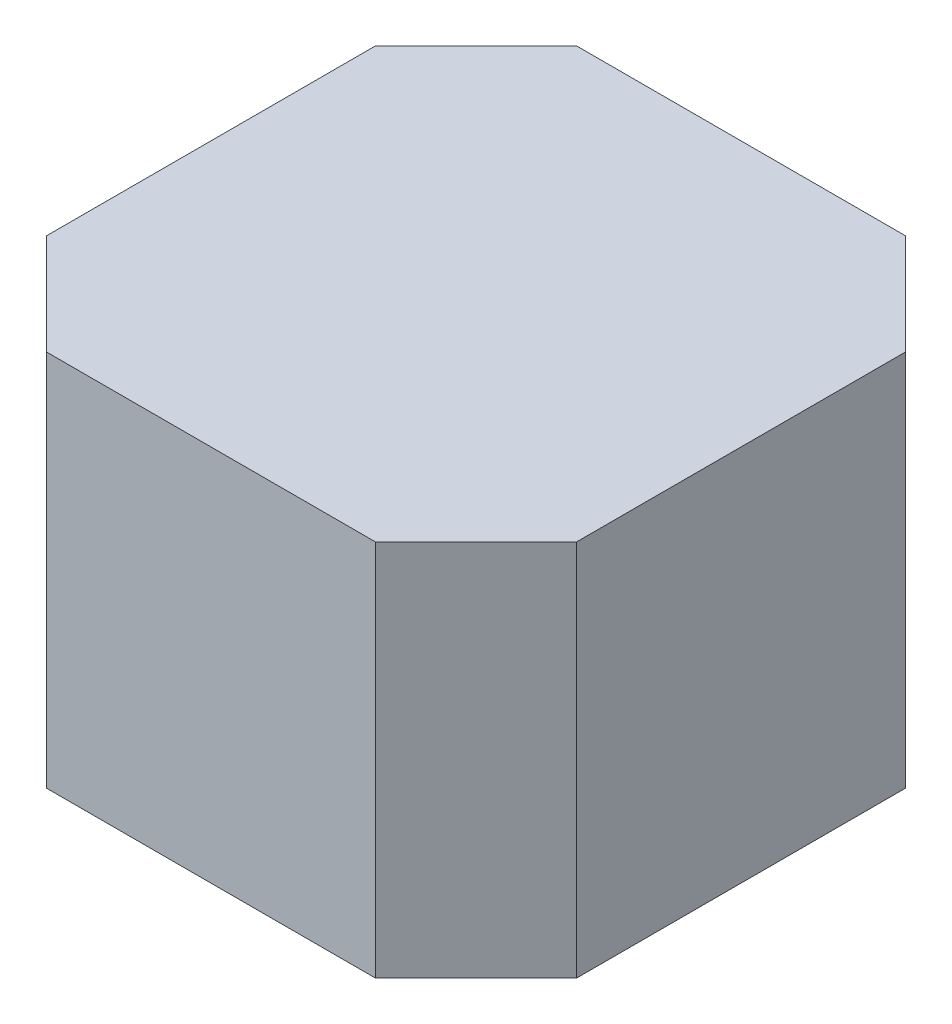
ISO-10303-21;
HEADER;
FILE_DESCRIPTION(('STEP AP214'),'2;1');
FILE_NAME('part.step','',(''),(''),'','','');
FILE_SCHEMA(('AUTOMOTIVE_DESIGN { 1 0 10303 214 1 1 1 1 }'));
ENDSEC;
DATA;
#1=APPLICATION_CONTEXT('core data for automotive mechanical design processes');
#2=APPLICATION_PROTOCOL_DEFINITION('international standard','automotive_design',2000,#1);
#3=PRODUCT_CONTEXT('',#1,'mechanical');
#4=PRODUCT('Part','Part','',(#3));
#5=PRODUCT_RELATED_PRODUCT_CATEGORY('part','',(#4));
#6=PRODUCT_DEFINITION_FORMATION('','',#4);
#7=PRODUCT_DEFINITION_CONTEXT('part definition',#1,'design');
#8=PRODUCT_DEFINITION('design','',#6,#7);
#9=PRODUCT_DEFINITION_SHAPE('','',#8);
#10=(LENGTH_UNIT() NAMED_UNIT(*) SI_UNIT(.MILLI.,.METRE.));
#11=(NAMED_UNIT(*) PLANE_ANGLE_UNIT() SI_UNIT($,.RADIAN.));
#12=(NAMED_UNIT(*) SI_UNIT($,.STERADIAN.) SOLID_ANGLE_UNIT());
#13=UNCERTAINTY_MEASURE_WITH_UNIT(LENGTH_MEASURE(1.E-05),#10,'distance_accuracy_value','');
#14=(GEOMETRIC_REPRESENTATION_CONTEXT(3) GLOBAL_UNCERTAINTY_ASSIGNED_CONTEXT((#13)) GLOBAL_UNIT_ASSIGNED_CONTEXT((#10,
#11,#12)) REPRESENTATION_CONTEXT('',''));
#15=CARTESIAN_POINT('',(0.,0.,0.));
#16=DIRECTION('',(0.,0.,1.));
#17=DIRECTION('',(1.,0.,0.));
#18=AXIS2_PLACEMENT_3D('',#15,#16,#17);
#19=CARTESIAN_POINT('',(21.05,30.,21.05));
#20=DIRECTION('',(-1.,0.,0.));
#21=DIRECTION('',(0.,0.,1.));
#22=AXIS2_PLACEMENT_3D('',#19,#20,#21);
#23=PLANE('',#22);
#24=DIRECTION('',(0.,0.,-1.));
#25=VECTOR('',#24,1.);
#26=CARTESIAN_POINT('',(21.05,0.,21.05));
#27=LINE('',#26,#25);
#28=CARTESIAN_POINT('',(21.05,0.,13.05));
#29=VERTEX_POINT('',#28);
#30=CARTESIAN_POINT('',(21.05,0.,-13.05));
#31=VERTEX_POINT('',#30);
#32=EDGE_CURVE('E128',#29,#31,#27,.T.);
#33=ORIENTED_EDGE('',*,*,#32,.T.);
#34=DIRECTION('',(0.,1.,0.));
#35=VECTOR('',#34,1.);
#36=CARTESIAN_POINT('',(21.05,30.,-13.05));
#37=LINE('',#36,#35);
#38=CARTESIAN_POINT('',(21.05,30.,-13.05));
#39=VERTEX_POINT('',#38);
#40=EDGE_CURVE('E151',#31,#39,#37,.T.);
#41=ORIENTED_EDGE('',*,*,#40,.T.);
#42=DIRECTION('',(0.,0.,-1.));
#43=VECTOR('',#42,1.);
#44=CARTESIAN_POINT('',(21.05,30.,21.05));
#45=LINE('',#44,#43);
#46=CARTESIAN_POINT('',(21.05,30.,13.05));
#47=VERTEX_POINT('',#46);
#48=EDGE_CURVE('E126',#47,#39,#45,.T.);
#49=ORIENTED_EDGE('',*,*,#48,.F.);
#50=DIRECTION('',(0.,-1.,0.));
#51=VECTOR('',#50,1.);
#52=CARTESIAN_POINT('',(21.05,30.,13.05));
#53=LINE('',#52,#51);
#54=EDGE_CURVE('E148',#47,#29,#53,.T.);
#55=ORIENTED_EDGE('',*,*,#54,.T.);
#56=EDGE_LOOP('',(#33,#41,#49,#55));
#57=FACE_BOUND('',#56,.T.);
#58=ADVANCED_FACE('F33',(#57),#23,.F.);
#59=CARTESIAN_POINT('',(-21.05,30.,-21.05));
#60=DIRECTION('',(0.,0.,1.));
#61=DIRECTION('',(1.,0.,0.));
#62=AXIS2_PLACEMENT_3D('',#59,#60,#61);
#63=PLANE('',#62);
#64=DIRECTION('',(-1.,0.,0.));
#65=VECTOR('',#64,1.);
#66=CARTESIAN_POINT('',(-21.05,0.,-21.05));
#67=LINE('',#66,#65);
#68=CARTESIAN_POINT('',(13.05,0.,-21.05));
#69=VERTEX_POINT('',#68);
#70=CARTESIAN_POINT('',(-13.05,0.,-21.05));
#71=VERTEX_POINT('',#70);
#72=EDGE_CURVE('E124',#69,#71,#67,.T.);
#73=ORIENTED_EDGE('',*,*,#72,.T.);
#74=DIRECTION('',(0.,1.,0.));
#75=VECTOR('',#74,1.);
#76=CARTESIAN_POINT('',(-13.05,30.,-21.05));
#77=LINE('',#76,#75);
#78=CARTESIAN_POINT('',(-13.05,30.,-21.05));
#79=VERTEX_POINT('',#78);
#80=EDGE_CURVE('E103',#71,#79,#77,.T.);
#81=ORIENTED_EDGE('',*,*,#80,.T.);
#82=DIRECTION('',(-1.,0.,0.));
#83=VECTOR('',#82,1.);
#84=CARTESIAN_POINT('',(-21.05,30.,-21.05));
#85=LINE('',#84,#83);
#86=CARTESIAN_POINT('',(13.05,30.,-21.05));
#87=VERTEX_POINT('',#86);
#88=EDGE_CURVE('E167',#87,#79,#85,.T.);
#89=ORIENTED_EDGE('',*,*,#88,.F.);
#90=DIRECTION('',(0.,-1.,0.));
#91=VECTOR('',#90,1.);
#92=CARTESIAN_POINT('',(13.05,30.,-21.05));
#93=LINE('',#92,#91);
#94=EDGE_CURVE('E108',#87,#69,#93,.T.);
#95=ORIENTED_EDGE('',*,*,#94,.T.);
#96=EDGE_LOOP('',(#73,#81,#89,#95));
#97=FACE_BOUND('',#96,.T.);
#98=ADVANCED_FACE('F184',(#97),#63,.F.);
#99=CARTESIAN_POINT('',(-21.05,30.,21.05));
#100=DIRECTION('',(1.,0.,0.));
#101=DIRECTION('',(0.,0.,-1.));
#102=AXIS2_PLACEMENT_3D('',#99,#100,#101);
#103=PLANE('',#102);
#104=DIRECTION('',(0.,0.,1.));
#105=VECTOR('',#104,1.);
#106=CARTESIAN_POINT('',(-21.05,30.,21.05));
#107=LINE('',#106,#105);
#108=CARTESIAN_POINT('',(-21.05,30.,-13.05));
#109=VERTEX_POINT('',#108);
#110=CARTESIAN_POINT('',(-21.05,30.,13.05));
#111=VERTEX_POINT('',#110);
#112=EDGE_CURVE('E117',#109,#111,#107,.T.);
#113=ORIENTED_EDGE('',*,*,#112,.F.);
#114=DIRECTION('',(0.,-1.,0.));
#115=VECTOR('',#114,1.);
#116=CARTESIAN_POINT('',(-21.05,30.,-13.05));
#117=LINE('',#116,#115);
#118=CARTESIAN_POINT('',(-21.05,0.,-13.05));
#119=VERTEX_POINT('',#118);
#120=EDGE_CURVE('E102',#109,#119,#117,.T.);
#121=ORIENTED_EDGE('',*,*,#120,.T.);
#122=DIRECTION('',(0.,0.,1.));
#123=VECTOR('',#122,1.);
#124=CARTESIAN_POINT('',(-21.05,0.,21.05));
#125=LINE('',#124,#123);
#126=CARTESIAN_POINT('',(-21.05,0.,13.05));
#127=VERTEX_POINT('',#126);
#128=EDGE_CURVE('E115',#119,#127,#125,.T.);
#129=ORIENTED_EDGE('',*,*,#128,.T.);
#130=DIRECTION('',(0.,1.,0.));
#131=VECTOR('',#130,1.);
#132=CARTESIAN_POINT('',(-21.05,30.,13.05));
#133=LINE('',#132,#131);
#134=EDGE_CURVE('E119',#127,#111,#133,.T.);
#135=ORIENTED_EDGE('',*,*,#134,.T.);
#136=EDGE_LOOP('',(#113,#121,#129,#135));
#137=FACE_BOUND('',#136,.T.);
#138=ADVANCED_FACE('F114',(#137),#103,.F.);
#139=CARTESIAN_POINT('',(-21.05,30.,21.05));
#140=DIRECTION('',(0.,0.,-1.));
#141=DIRECTION('',(-1.,0.,0.));
#142=AXIS2_PLACEMENT_3D('',#139,#140,#141);
#143=PLANE('',#142);
#144=DIRECTION('',(1.,0.,0.));
#145=VECTOR('',#144,1.);
#146=CARTESIAN_POINT('',(-21.05,0.,21.05));
#147=LINE('',#146,#145);
#148=CARTESIAN_POINT('',(-13.05,0.,21.05));
#149=VERTEX_POINT('',#148);
#150=CARTESIAN_POINT('',(13.05,0.,21.05));
#151=VERTEX_POINT('',#150);
#152=EDGE_CURVE('E123',#149,#151,#147,.T.);
#153=ORIENTED_EDGE('',*,*,#152,.T.);
#154=DIRECTION('',(0.,1.,0.));
#155=VECTOR('',#154,1.);
#156=CARTESIAN_POINT('',(13.05,30.,21.05));
#157=LINE('',#156,#155);
#158=CARTESIAN_POINT('',(13.05,30.,21.05));
#159=VERTEX_POINT('',#158);
#160=EDGE_CURVE('E11',#151,#159,#157,.T.);
#161=ORIENTED_EDGE('',*,*,#160,.T.);
#162=DIRECTION('',(1.,0.,0.));
#163=VECTOR('',#162,1.);
#164=CARTESIAN_POINT('',(-21.05,30.,21.05));
#165=LINE('',#164,#163);
#166=CARTESIAN_POINT('',(-13.05,30.,21.05));
#167=VERTEX_POINT('',#166);
#168=EDGE_CURVE('E132',#167,#159,#165,.T.);
#169=ORIENTED_EDGE('',*,*,#168,.F.);
#170=DIRECTION('',(0.,-1.,0.));
#171=VECTOR('',#170,1.);
#172=CARTESIAN_POINT('',(-13.05,30.,21.05));
#173=LINE('',#172,#171);
#174=EDGE_CURVE('E41',#167,#149,#173,.T.);
#175=ORIENTED_EDGE('',*,*,#174,.T.);
#176=EDGE_LOOP('',(#153,#161,#169,#175));
#177=FACE_BOUND('',#176,.T.);
#178=ADVANCED_FACE('F154',(#177),#143,.F.);
#179=CARTESIAN_POINT('',(0.,30.,0.));
#180=DIRECTION('',(0.,-1.,0.));
#181=DIRECTION('',(0.,0.,-1.));
#182=AXIS2_PLACEMENT_3D('',#179,#180,#181);
#183=PLANE('',#182);
#184=ORIENTED_EDGE('',*,*,#88,.T.);
#185=DIRECTION('',(0.707106781186549,0.,-0.707106781186546));
#186=VECTOR('',#185,1.);
#187=CARTESIAN_POINT('',(-21.05,30.,-13.05));
#188=LINE('',#187,#186);
#189=EDGE_CURVE('E146',#79,#109,#188,.F.);
#190=ORIENTED_EDGE('',*,*,#189,.T.);
#191=ORIENTED_EDGE('',*,*,#112,.T.);
#192=DIRECTION('',(-0.707106781186546,0.,-0.707106781186549));
#193=VECTOR('',#192,1.);
#194=CARTESIAN_POINT('',(-13.05,30.,21.05));
#195=LINE('',#194,#193);
#196=EDGE_CURVE('E53',#111,#167,#195,.F.);
#197=ORIENTED_EDGE('',*,*,#196,.T.);
#198=ORIENTED_EDGE('',*,*,#168,.T.);
#199=DIRECTION('',(-0.707106781186549,0.,0.707106781186546));
#200=VECTOR('',#199,1.);
#201=CARTESIAN_POINT('',(21.05,30.,13.05));
#202=LINE('',#201,#200);
#203=EDGE_CURVE('E142',#159,#47,#202,.F.);
#204=ORIENTED_EDGE('',*,*,#203,.T.);
#205=ORIENTED_EDGE('',*,*,#48,.T.);
#206=DIRECTION('',(0.707106781186546,0.,0.707106781186549));
#207=VECTOR('',#206,1.);
#208=CARTESIAN_POINT('',(13.05,30.,-21.05));
#209=LINE('',#208,#207);
#210=EDGE_CURVE('E144',#39,#87,#209,.F.);
#211=ORIENTED_EDGE('',*,*,#210,.T.);
#212=EDGE_LOOP('',(#184,#190,#191,#197,#198,#204,#205,#211));
#213=FACE_BOUND('',#212,.T.);
#214=ADVANCED_FACE('F173',(#213),#183,.F.);
#215=CARTESIAN_POINT('',(0.,0.,0.));
#216=DIRECTION('',(0.,-1.,0.));
#217=DIRECTION('',(0.,0.,-1.));
#218=AXIS2_PLACEMENT_3D('',#215,#216,#217);
#219=PLANE('',#218);
#220=ORIENTED_EDGE('',*,*,#128,.F.);
#221=DIRECTION('',(-0.707106781186549,0.,0.707106781186546));
#222=VECTOR('',#221,1.);
#223=CARTESIAN_POINT('',(-17.05,0.,-17.05));
#224=LINE('',#223,#222);
#225=EDGE_CURVE('E98',#119,#71,#224,.F.);
#226=ORIENTED_EDGE('',*,*,#225,.T.);
#227=ORIENTED_EDGE('',*,*,#72,.F.);
#228=DIRECTION('',(-0.707106781186546,0.,-0.707106781186549));
#229=VECTOR('',#228,1.);
#230=CARTESIAN_POINT('',(17.05,0.,-17.05));
#231=LINE('',#230,#229);
#232=EDGE_CURVE('E109',#69,#31,#231,.F.);
#233=ORIENTED_EDGE('',*,*,#232,.T.);
#234=ORIENTED_EDGE('',*,*,#32,.F.);
#235=DIRECTION('',(0.707106781186549,0.,-0.707106781186546));
#236=VECTOR('',#235,1.);
#237=CARTESIAN_POINT('',(17.05,0.,17.05));
#238=LINE('',#237,#236);
#239=EDGE_CURVE('E135',#29,#151,#238,.F.);
#240=ORIENTED_EDGE('',*,*,#239,.T.);
#241=ORIENTED_EDGE('',*,*,#152,.F.);
#242=DIRECTION('',(0.707106781186546,0.,0.707106781186549));
#243=VECTOR('',#242,1.);
#244=CARTESIAN_POINT('',(-17.05,0.,17.05));
#245=LINE('',#244,#243);
#246=EDGE_CURVE('E118',#149,#127,#245,.F.);
#247=ORIENTED_EDGE('',*,*,#246,.T.);
#248=EDGE_LOOP('',(#220,#226,#227,#233,#234,#240,#241,#247));
#249=FACE_BOUND('',#248,.T.);
#250=ADVANCED_FACE('F121',(#249),#219,.T.);
#251=CARTESIAN_POINT('',(-21.05,30.,-13.05));
#252=DIRECTION('',(0.707106781186546,0.,0.707106781186549));
#253=DIRECTION('',(0.,-1.,0.));
#254=AXIS2_PLACEMENT_3D('',#251,#252,#253);
#255=PLANE('',#254);
#256=ORIENTED_EDGE('',*,*,#189,.F.);
#257=ORIENTED_EDGE('',*,*,#80,.F.);
#258=ORIENTED_EDGE('',*,*,#225,.F.);
#259=ORIENTED_EDGE('',*,*,#120,.F.);
#260=EDGE_LOOP('',(#256,#257,#258,#259));
#261=FACE_BOUND('',#260,.T.);
#262=ADVANCED_FACE('F101',(#261),#255,.F.);
#263=CARTESIAN_POINT('',(13.05,30.,-21.05));
#264=DIRECTION('',(-0.707106781186549,0.,0.707106781186546));
#265=DIRECTION('',(0.,-1.,0.));
#266=AXIS2_PLACEMENT_3D('',#263,#264,#265);
#267=PLANE('',#266);
#268=ORIENTED_EDGE('',*,*,#210,.F.);
#269=ORIENTED_EDGE('',*,*,#40,.F.);
#270=ORIENTED_EDGE('',*,*,#232,.F.);
#271=ORIENTED_EDGE('',*,*,#94,.F.);
#272=EDGE_LOOP('',(#268,#269,#270,#271));
#273=FACE_BOUND('',#272,.T.);
#274=ADVANCED_FACE('F195',(#273),#267,.F.);
#275=CARTESIAN_POINT('',(21.05,30.,13.05));
#276=DIRECTION('',(-0.707106781186546,0.,-0.707106781186549));
#277=DIRECTION('',(0.,-1.,0.));
#278=AXIS2_PLACEMENT_3D('',#275,#276,#277);
#279=PLANE('',#278);
#280=ORIENTED_EDGE('',*,*,#203,.F.);
#281=ORIENTED_EDGE('',*,*,#160,.F.);
#282=ORIENTED_EDGE('',*,*,#239,.F.);
#283=ORIENTED_EDGE('',*,*,#54,.F.);
#284=EDGE_LOOP('',(#280,#281,#282,#283));
#285=FACE_BOUND('',#284,.T.);
#286=ADVANCED_FACE('F161',(#285),#279,.F.);
#287=CARTESIAN_POINT('',(-13.05,30.,21.05));
#288=DIRECTION('',(0.707106781186549,0.,-0.707106781186546));
#289=DIRECTION('',(0.,-1.,0.));
#290=AXIS2_PLACEMENT_3D('',#287,#288,#289);
#291=PLANE('',#290);
#292=ORIENTED_EDGE('',*,*,#196,.F.);
#293=ORIENTED_EDGE('',*,*,#134,.F.);
#294=ORIENTED_EDGE('',*,*,#246,.F.);
#295=ORIENTED_EDGE('',*,*,#174,.F.);
#296=EDGE_LOOP('',(#292,#293,#294,#295));
#297=FACE_BOUND('',#296,.T.);
#298=ADVANCED_FACE('F35',(#297),#291,.F.);
#299=CLOSED_SHELL('',(#58,#98,#138,#178,#214,#250,#262,#274,#286,#298));
#300=MANIFOLD_SOLID_BREP('B2',#299);
#301=ADVANCED_BREP_SHAPE_REPRESENTATION('',(#18,#300),#14);
#302=SHAPE_DEFINITION_REPRESENTATION(#9,#301);
ENDSEC;
END-ISO-10303-21;
